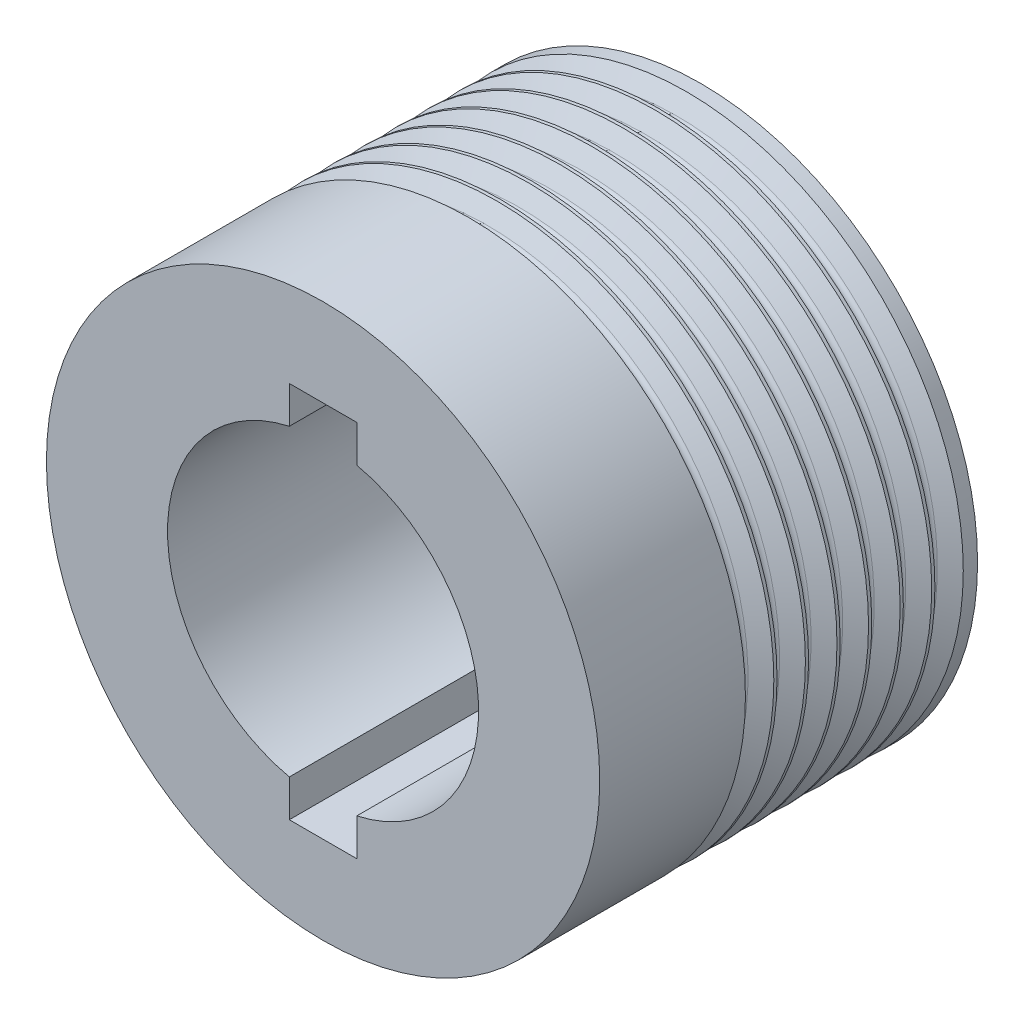
ISO-10303-21;
HEADER;
FILE_DESCRIPTION(('STEP AP214'),'2;1');
FILE_NAME('part.step','',(''),(''),'','','');
FILE_SCHEMA(('AUTOMOTIVE_DESIGN { 1 0 10303 214 1 1 1 1 }'));
ENDSEC;
DATA;
#1=APPLICATION_CONTEXT('core data for automotive mechanical design processes');
#2=APPLICATION_PROTOCOL_DEFINITION('international standard','automotive_design',2000,#1);
#3=PRODUCT_CONTEXT('',#1,'mechanical');
#4=PRODUCT('Part','Part','',(#3));
#5=PRODUCT_RELATED_PRODUCT_CATEGORY('part','',(#4));
#6=PRODUCT_DEFINITION_FORMATION('','',#4);
#7=PRODUCT_DEFINITION_CONTEXT('part definition',#1,'design');
#8=PRODUCT_DEFINITION('design','',#6,#7);
#9=PRODUCT_DEFINITION_SHAPE('','',#8);
#10=(LENGTH_UNIT() NAMED_UNIT(*) SI_UNIT(.MILLI.,.METRE.));
#11=(NAMED_UNIT(*) PLANE_ANGLE_UNIT() SI_UNIT($,.RADIAN.));
#12=(NAMED_UNIT(*) SI_UNIT($,.STERADIAN.) SOLID_ANGLE_UNIT());
#13=UNCERTAINTY_MEASURE_WITH_UNIT(LENGTH_MEASURE(1.E-05),#10,'distance_accuracy_value','');
#14=(GEOMETRIC_REPRESENTATION_CONTEXT(3) GLOBAL_UNCERTAINTY_ASSIGNED_CONTEXT((#13)) GLOBAL_UNIT_ASSIGNED_CONTEXT((#10,
#11,#12)) REPRESENTATION_CONTEXT('',''));
#15=CARTESIAN_POINT('',(0.,0.,0.));
#16=DIRECTION('',(0.,0.,1.));
#17=DIRECTION('',(1.,0.,0.));
#18=AXIS2_PLACEMENT_3D('',#15,#16,#17);
#19=CARTESIAN_POINT('',(0.,0.,28.));
#20=DIRECTION('',(0.,0.,-1.));
#21=DIRECTION('',(-1.,0.,0.));
#22=AXIS2_PLACEMENT_3D('',#19,#20,#21);
#23=CYLINDRICAL_SURFACE('',#22,11.525);
#24=DIRECTION('',(0.,0.,-1.));
#25=VECTOR('',#24,1.);
#26=CARTESIAN_POINT('',(2.5,-11.2505833182107,28.));
#27=LINE('',#26,#25);
#28=CARTESIAN_POINT('',(2.5,-11.2505833182107,28.));
#29=VERTEX_POINT('',#28);
#30=CARTESIAN_POINT('',(2.5,-11.2505833182107,0.));
#31=VERTEX_POINT('',#30);
#32=EDGE_CURVE('E11',#29,#31,#27,.T.);
#33=ORIENTED_EDGE('',*,*,#32,.F.);
#34=CARTESIAN_POINT('',(0.,0.,28.));
#35=DIRECTION('',(0.,0.,1.));
#36=DIRECTION('',(1.,0.,0.));
#37=AXIS2_PLACEMENT_3D('',#34,#35,#36);
#38=CIRCLE('',#37,11.525);
#39=CARTESIAN_POINT('',(2.5,11.2505833182107,28.));
#40=VERTEX_POINT('',#39);
#41=EDGE_CURVE('E125',#29,#40,#38,.T.);
#42=ORIENTED_EDGE('',*,*,#41,.T.);
#43=DIRECTION('',(0.,0.,-1.));
#44=VECTOR('',#43,1.);
#45=CARTESIAN_POINT('',(2.5,11.2505833182107,28.));
#46=LINE('',#45,#44);
#47=CARTESIAN_POINT('',(2.5,11.2505833182107,0.));
#48=VERTEX_POINT('',#47);
#49=EDGE_CURVE('E43',#48,#40,#46,.F.);
#50=ORIENTED_EDGE('',*,*,#49,.F.);
#51=CARTESIAN_POINT('',(0.,0.,0.));
#52=DIRECTION('',(0.,0.,1.));
#53=DIRECTION('',(1.,0.,0.));
#54=AXIS2_PLACEMENT_3D('',#51,#52,#53);
#55=CIRCLE('',#54,11.525);
#56=EDGE_CURVE('E193',#31,#48,#55,.T.);
#57=ORIENTED_EDGE('',*,*,#56,.F.);
#58=EDGE_LOOP('',(#33,#42,#50,#57));
#59=FACE_BOUND('',#58,.T.);
#60=ADVANCED_FACE('F35',(#59),#23,.F.);
#61=CARTESIAN_POINT('',(0.,0.,28.));
#62=DIRECTION('',(0.,0.,-1.));
#63=DIRECTION('',(-1.,0.,0.));
#64=AXIS2_PLACEMENT_3D('',#61,#62,#63);
#65=CYLINDRICAL_SURFACE('',#64,20.5);
#66=CARTESIAN_POINT('',(0.,0.,1.05849153852487));
#67=DIRECTION('',(0.,0.,-1.));
#68=DIRECTION('',(-1.,0.,0.));
#69=AXIS2_PLACEMENT_3D('',#66,#67,#68);
#70=CIRCLE('',#69,20.5);
#71=CARTESIAN_POINT('',(-20.5,0.,1.05849153852487));
#72=VERTEX_POINT('',#71);
#73=EDGE_CURVE('E196',#72,#72,#70,.T.);
#74=ORIENTED_EDGE('',*,*,#73,.T.);
#75=EDGE_LOOP('',(#74));
#76=FACE_BOUND('',#75,.T.);
#77=CARTESIAN_POINT('',(0.,0.,0.));
#78=DIRECTION('',(0.,0.,1.));
#79=DIRECTION('',(1.,0.,0.));
#80=AXIS2_PLACEMENT_3D('',#77,#78,#79);
#81=CIRCLE('',#80,20.5);
#82=CARTESIAN_POINT('',(20.5,0.,0.));
#83=VERTEX_POINT('',#82);
#84=EDGE_CURVE('E201',#83,#83,#81,.T.);
#85=ORIENTED_EDGE('',*,*,#84,.T.);
#86=EDGE_LOOP('',(#85));
#87=FACE_BOUND('',#86,.T.);
#88=ADVANCED_FACE('F281',(#76,#87),#65,.T.);
#89=CARTESIAN_POINT('',(0.,0.,17.2017394654647));
#90=DIRECTION('',(0.,0.,1.));
#91=DIRECTION('',(1.,0.,0.));
#92=AXIS2_PLACEMENT_3D('',#89,#90,#91);
#93=CIRCLE('',#92,20.5);
#94=CARTESIAN_POINT('',(20.5,0.,17.2017394654647));
#95=VERTEX_POINT('',#94);
#96=EDGE_CURVE('E206',#95,#95,#93,.T.);
#97=ORIENTED_EDGE('',*,*,#96,.T.);
#98=EDGE_LOOP('',(#97));
#99=FACE_BOUND('',#98,.T.);
#100=CARTESIAN_POINT('',(0.,0.,28.));
#101=DIRECTION('',(0.,0.,1.));
#102=DIRECTION('',(1.,0.,0.));
#103=AXIS2_PLACEMENT_3D('',#100,#101,#102);
#104=CIRCLE('',#103,20.5);
#105=CARTESIAN_POINT('',(20.5,0.,28.));
#106=VERTEX_POINT('',#105);
#107=EDGE_CURVE('E197',#106,#106,#104,.T.);
#108=ORIENTED_EDGE('',*,*,#107,.F.);
#109=EDGE_LOOP('',(#108));
#110=FACE_BOUND('',#109,.T.);
#111=ADVANCED_FACE('F286',(#99,#110),#65,.T.);
#112=CARTESIAN_POINT('',(0.,0.,28.));
#113=DIRECTION('',(0.,0.,1.));
#114=DIRECTION('',(1.,0.,0.));
#115=AXIS2_PLACEMENT_3D('',#112,#113,#114);
#116=PLANE('',#115);
#117=DIRECTION('',(0.,-1.,0.));
#118=VECTOR('',#117,1.);
#119=CARTESIAN_POINT('',(2.5,14.,28.));
#120=LINE('',#119,#118);
#121=CARTESIAN_POINT('',(2.5,14.,28.));
#122=VERTEX_POINT('',#121);
#123=EDGE_CURVE('E118',#122,#40,#120,.T.);
#124=ORIENTED_EDGE('',*,*,#123,.T.);
#125=ORIENTED_EDGE('',*,*,#41,.F.);
#126=CARTESIAN_POINT('',(2.5,-14.,28.));
#127=VERTEX_POINT('',#126);
#128=EDGE_CURVE('E102',#29,#127,#120,.T.);
#129=ORIENTED_EDGE('',*,*,#128,.T.);
#130=DIRECTION('',(-1.,0.,0.));
#131=VECTOR('',#130,1.);
#132=CARTESIAN_POINT('',(2.5,-14.,28.));
#133=LINE('',#132,#131);
#134=CARTESIAN_POINT('',(-2.5,-14.,28.));
#135=VERTEX_POINT('',#134);
#136=EDGE_CURVE('E113',#127,#135,#133,.T.);
#137=ORIENTED_EDGE('',*,*,#136,.T.);
#138=DIRECTION('',(0.,1.,0.));
#139=VECTOR('',#138,1.);
#140=CARTESIAN_POINT('',(-2.5,14.,28.));
#141=LINE('',#140,#139);
#142=CARTESIAN_POINT('',(-2.5,-11.2505833182107,28.));
#143=VERTEX_POINT('',#142);
#144=EDGE_CURVE('E131',#135,#143,#141,.T.);
#145=ORIENTED_EDGE('',*,*,#144,.T.);
#146=CARTESIAN_POINT('',(-2.5,11.2505833182107,28.));
#147=VERTEX_POINT('',#146);
#148=EDGE_CURVE('E191',#147,#143,#38,.T.);
#149=ORIENTED_EDGE('',*,*,#148,.F.);
#150=CARTESIAN_POINT('',(-2.5,14.,28.));
#151=VERTEX_POINT('',#150);
#152=EDGE_CURVE('E58',#147,#151,#141,.T.);
#153=ORIENTED_EDGE('',*,*,#152,.T.);
#154=DIRECTION('',(1.,0.,0.));
#155=VECTOR('',#154,1.);
#156=CARTESIAN_POINT('',(2.5,14.,28.));
#157=LINE('',#156,#155);
#158=EDGE_CURVE('E110',#151,#122,#157,.T.);
#159=ORIENTED_EDGE('',*,*,#158,.T.);
#160=EDGE_LOOP('',(#124,#125,#129,#137,#145,#149,#153,#159));
#161=FACE_BOUND('',#160,.T.);
#162=ORIENTED_EDGE('',*,*,#107,.T.);
#163=EDGE_LOOP('',(#162));
#164=FACE_BOUND('',#163,.T.);
#165=ADVANCED_FACE('F122',(#161,#164),#116,.T.);
#166=CARTESIAN_POINT('',(0.,0.,0.));
#167=DIRECTION('',(0.,0.,1.));
#168=DIRECTION('',(1.,0.,0.));
#169=AXIS2_PLACEMENT_3D('',#166,#167,#168);
#170=PLANE('',#169);
#171=ORIENTED_EDGE('',*,*,#84,.F.);
#172=EDGE_LOOP('',(#171));
#173=FACE_BOUND('',#172,.T.);
#174=ORIENTED_EDGE('',*,*,#56,.T.);
#175=DIRECTION('',(0.,-1.,0.));
#176=VECTOR('',#175,1.);
#177=CARTESIAN_POINT('',(2.5,14.,0.));
#178=LINE('',#177,#176);
#179=CARTESIAN_POINT('',(2.5,14.,0.));
#180=VERTEX_POINT('',#179);
#181=EDGE_CURVE('E135',#180,#48,#178,.T.);
#182=ORIENTED_EDGE('',*,*,#181,.F.);
#183=DIRECTION('',(1.,0.,0.));
#184=VECTOR('',#183,1.);
#185=CARTESIAN_POINT('',(2.5,14.,0.));
#186=LINE('',#185,#184);
#187=CARTESIAN_POINT('',(-2.5,14.,0.));
#188=VERTEX_POINT('',#187);
#189=EDGE_CURVE('E126',#188,#180,#186,.T.);
#190=ORIENTED_EDGE('',*,*,#189,.F.);
#191=DIRECTION('',(0.,1.,0.));
#192=VECTOR('',#191,1.);
#193=CARTESIAN_POINT('',(-2.5,14.,0.));
#194=LINE('',#193,#192);
#195=CARTESIAN_POINT('',(-2.5,11.2505833182107,0.));
#196=VERTEX_POINT('',#195);
#197=EDGE_CURVE('E139',#196,#188,#194,.T.);
#198=ORIENTED_EDGE('',*,*,#197,.F.);
#199=CARTESIAN_POINT('',(-2.5,-11.2505833182107,0.));
#200=VERTEX_POINT('',#199);
#201=EDGE_CURVE('E192',#196,#200,#55,.T.);
#202=ORIENTED_EDGE('',*,*,#201,.T.);
#203=CARTESIAN_POINT('',(-2.5,-14.,0.));
#204=VERTEX_POINT('',#203);
#205=EDGE_CURVE('E50',#204,#200,#194,.T.);
#206=ORIENTED_EDGE('',*,*,#205,.F.);
#207=DIRECTION('',(-1.,0.,0.));
#208=VECTOR('',#207,1.);
#209=CARTESIAN_POINT('',(2.5,-14.,0.));
#210=LINE('',#209,#208);
#211=CARTESIAN_POINT('',(2.5,-14.,0.));
#212=VERTEX_POINT('',#211);
#213=EDGE_CURVE('E137',#212,#204,#210,.T.);
#214=ORIENTED_EDGE('',*,*,#213,.F.);
#215=EDGE_CURVE('E105',#31,#212,#178,.T.);
#216=ORIENTED_EDGE('',*,*,#215,.F.);
#217=EDGE_LOOP('',(#174,#182,#190,#198,#202,#206,#214,#216));
#218=FACE_BOUND('',#217,.T.);
#219=ADVANCED_FACE('F255',(#173,#218),#170,.F.);
#220=DIRECTION('',(0.,0.,-1.));
#221=VECTOR('',#220,1.);
#222=CARTESIAN_POINT('',(-2.5,11.2505833182107,28.));
#223=LINE('',#222,#221);
#224=EDGE_CURVE('E245',#147,#196,#223,.T.);
#225=ORIENTED_EDGE('',*,*,#224,.F.);
#226=ORIENTED_EDGE('',*,*,#148,.T.);
#227=DIRECTION('',(0.,0.,-1.));
#228=VECTOR('',#227,1.);
#229=CARTESIAN_POINT('',(-2.5,-11.2505833182107,28.));
#230=LINE('',#229,#228);
#231=EDGE_CURVE('E200',#200,#143,#230,.F.);
#232=ORIENTED_EDGE('',*,*,#231,.F.);
#233=ORIENTED_EDGE('',*,*,#201,.F.);
#234=EDGE_LOOP('',(#225,#226,#232,#233));
#235=FACE_BOUND('',#234,.T.);
#236=ADVANCED_FACE('F261',(#235),#23,.F.);
#237=CARTESIAN_POINT('',(0.,0.,17.2599999999999));
#238=DIRECTION('',(0.,0.,1.));
#239=DIRECTION('',(1.,0.,0.));
#240=AXIS2_PLACEMENT_3D('',#237,#238,#239);
#241=CONICAL_SURFACE('',#240,20.5999999999999,1.04326521248382);
#242=CARTESIAN_POINT('',(0.,0.,16.4971337500661));
#243=DIRECTION('',(0.,0.,-1.));
#244=DIRECTION('',(-1.,0.,0.));
#245=AXIS2_PLACEMENT_3D('',#242,#243,#244);
#246=CIRCLE('',#245,19.2905951755875);
#247=CARTESIAN_POINT('',(-19.2905951755875,0.,16.4971337500661));
#248=VERTEX_POINT('',#247);
#249=EDGE_CURVE('E183',#248,#248,#246,.T.);
#250=ORIENTED_EDGE('',*,*,#249,.F.);
#251=EDGE_LOOP('',(#250));
#252=FACE_BOUND('',#251,.T.);
#253=ORIENTED_EDGE('',*,*,#96,.F.);
#254=EDGE_LOOP('',(#253));
#255=FACE_BOUND('',#254,.T.);
#256=ADVANCED_FACE('F292',(#252,#255),#241,.T.);
#257=CARTESIAN_POINT('',(0.,0.,15.8062391546756));
#258=DIRECTION('',(0.,0.,-1.));
#259=DIRECTION('',(-1.,0.,0.));
#260=AXIS2_PLACEMENT_3D('',#257,#258,#259);
#261=CONICAL_SURFACE('',#260,19.2899999999999,1.04154230006183);
#262=CARTESIAN_POINT('',(0.,0.,15.8062391546756));
#263=DIRECTION('',(0.,0.,-1.));
#264=DIRECTION('',(-1.,0.,0.));
#265=AXIS2_PLACEMENT_3D('',#262,#263,#264);
#266=CIRCLE('',#265,19.2899999999999);
#267=CARTESIAN_POINT('',(-19.2899999999999,0.,15.8062391546756));
#268=VERTEX_POINT('',#267);
#269=EDGE_CURVE('E143',#268,#268,#266,.T.);
#270=ORIENTED_EDGE('',*,*,#269,.T.);
#271=EDGE_LOOP('',(#270));
#272=FACE_BOUND('',#271,.T.);
#273=CARTESIAN_POINT('',(0.,0.,15.0984915385248));
#274=DIRECTION('',(0.,0.,-1.));
#275=DIRECTION('',(-1.,0.,0.));
#276=AXIS2_PLACEMENT_3D('',#273,#274,#275);
#277=CIRCLE('',#276,20.5);
#278=CARTESIAN_POINT('',(-20.5,0.,15.0984915385248));
#279=VERTEX_POINT('',#278);
#280=EDGE_CURVE('E155',#279,#279,#277,.T.);
#281=ORIENTED_EDGE('',*,*,#280,.F.);
#282=EDGE_LOOP('',(#281));
#283=FACE_BOUND('',#282,.T.);
#284=ADVANCED_FACE('F297',(#272,#283),#261,.T.);
#285=CARTESIAN_POINT('',(0.,0.,16.1515127325845));
#286=DIRECTION('',(0.,0.,-1.));
#287=DIRECTION('',(-1.,0.,0.));
#288=AXIS2_PLACEMENT_3D('',#285,#286,#287);
#289=TOROIDAL_SURFACE('',#288,19.4919558278386,0.400000000000001);
#290=ORIENTED_EDGE('',*,*,#269,.F.);
#291=EDGE_LOOP('',(#290));
#292=FACE_BOUND('',#291,.T.);
#293=ORIENTED_EDGE('',*,*,#249,.T.);
#294=EDGE_LOOP('',(#293));
#295=FACE_BOUND('',#294,.T.);
#296=ADVANCED_FACE('F385',(#292,#295),#289,.F.);
#297=CARTESIAN_POINT('',(0.,0.,1.76623915467571));
#298=DIRECTION('',(0.,0.,-1.));
#299=DIRECTION('',(-1.,0.,0.));
#300=AXIS2_PLACEMENT_3D('',#297,#298,#299);
#301=CONICAL_SURFACE('',#300,19.29,1.04154230006183);
#302=CARTESIAN_POINT('',(0.,0.,1.76623915467571));
#303=DIRECTION('',(0.,0.,-1.));
#304=DIRECTION('',(-1.,0.,0.));
#305=AXIS2_PLACEMENT_3D('',#302,#303,#304);
#306=CIRCLE('',#305,19.29);
#307=CARTESIAN_POINT('',(-19.29,0.,1.76623915467571));
#308=VERTEX_POINT('',#307);
#309=EDGE_CURVE('E148',#308,#308,#306,.T.);
#310=ORIENTED_EDGE('',*,*,#309,.T.);
#311=EDGE_LOOP('',(#310));
#312=FACE_BOUND('',#311,.T.);
#313=ORIENTED_EDGE('',*,*,#73,.F.);
#314=EDGE_LOOP('',(#313));
#315=FACE_BOUND('',#314,.T.);
#316=ADVANCED_FACE('F388',(#312,#315),#301,.T.);
#317=CARTESIAN_POINT('',(0.,0.,3.22000000000001));
#318=DIRECTION('',(0.,0.,1.));
#319=DIRECTION('',(1.,0.,0.));
#320=AXIS2_PLACEMENT_3D('',#317,#318,#319);
#321=CONICAL_SURFACE('',#320,20.6,1.04326521248382);
#322=CARTESIAN_POINT('',(0.,0.,2.45713375006612));
#323=DIRECTION('',(0.,0.,-1.));
#324=DIRECTION('',(-1.,0.,0.));
#325=AXIS2_PLACEMENT_3D('',#322,#323,#324);
#326=CIRCLE('',#325,19.2905951755876);
#327=CARTESIAN_POINT('',(-19.2905951755876,0.,2.45713375006612));
#328=VERTEX_POINT('',#327);
#329=EDGE_CURVE('E151',#328,#328,#326,.T.);
#330=ORIENTED_EDGE('',*,*,#329,.F.);
#331=EDGE_LOOP('',(#330));
#332=FACE_BOUND('',#331,.T.);
#333=CARTESIAN_POINT('',(0.,0.,3.1617394654647));
#334=DIRECTION('',(0.,0.,1.));
#335=DIRECTION('',(1.,0.,0.));
#336=AXIS2_PLACEMENT_3D('',#333,#334,#335);
#337=CIRCLE('',#336,20.5);
#338=CARTESIAN_POINT('',(20.5,0.,3.1617394654647));
#339=VERTEX_POINT('',#338);
#340=EDGE_CURVE('E239',#339,#339,#337,.T.);
#341=ORIENTED_EDGE('',*,*,#340,.F.);
#342=EDGE_LOOP('',(#341));
#343=FACE_BOUND('',#342,.T.);
#344=ADVANCED_FACE('F329',(#332,#343),#321,.T.);
#345=CARTESIAN_POINT('',(0.,0.,2.11151273258456));
#346=DIRECTION('',(0.,0.,-1.));
#347=DIRECTION('',(-1.,0.,0.));
#348=AXIS2_PLACEMENT_3D('',#345,#346,#347);
#349=TOROIDAL_SURFACE('',#348,19.4919558278387,0.4);
#350=ORIENTED_EDGE('',*,*,#309,.F.);
#351=EDGE_LOOP('',(#350));
#352=FACE_BOUND('',#351,.T.);
#353=ORIENTED_EDGE('',*,*,#329,.T.);
#354=EDGE_LOOP('',(#353));
#355=FACE_BOUND('',#354,.T.);
#356=ADVANCED_FACE('F319',(#352,#355),#349,.F.);
#357=CARTESIAN_POINT('',(0.,0.,14.8617394654647));
#358=DIRECTION('',(0.,0.,1.));
#359=DIRECTION('',(1.,0.,0.));
#360=AXIS2_PLACEMENT_3D('',#357,#358,#359);
#361=CIRCLE('',#360,20.5);
#362=CARTESIAN_POINT('',(20.5,0.,14.8617394654647));
#363=VERTEX_POINT('',#362);
#364=EDGE_CURVE('E212',#363,#363,#361,.T.);
#365=ORIENTED_EDGE('',*,*,#364,.T.);
#366=EDGE_LOOP('',(#365));
#367=FACE_BOUND('',#366,.T.);
#368=ORIENTED_EDGE('',*,*,#280,.T.);
#369=EDGE_LOOP('',(#368));
#370=FACE_BOUND('',#369,.T.);
#371=ADVANCED_FACE('F309',(#367,#370),#65,.T.);
#372=CARTESIAN_POINT('',(0.,0.,14.92));
#373=DIRECTION('',(0.,0.,1.));
#374=DIRECTION('',(1.,0.,0.));
#375=AXIS2_PLACEMENT_3D('',#372,#373,#374);
#376=CONICAL_SURFACE('',#375,20.5999999999999,1.04326521248382);
#377=CARTESIAN_POINT('',(0.,0.,14.1571337500661));
#378=DIRECTION('',(0.,0.,-1.));
#379=DIRECTION('',(-1.,0.,0.));
#380=AXIS2_PLACEMENT_3D('',#377,#378,#379);
#381=CIRCLE('',#380,19.2905951755875);
#382=CARTESIAN_POINT('',(-19.2905951755875,0.,14.1571337500661));
#383=VERTEX_POINT('',#382);
#384=EDGE_CURVE('E177',#383,#383,#381,.T.);
#385=ORIENTED_EDGE('',*,*,#384,.F.);
#386=EDGE_LOOP('',(#385));
#387=FACE_BOUND('',#386,.T.);
#388=ORIENTED_EDGE('',*,*,#364,.F.);
#389=EDGE_LOOP('',(#388));
#390=FACE_BOUND('',#389,.T.);
#391=ADVANCED_FACE('F318',(#387,#390),#376,.T.);
#392=CARTESIAN_POINT('',(0.,0.,13.4662391546757));
#393=DIRECTION('',(0.,0.,-1.));
#394=DIRECTION('',(-1.,0.,0.));
#395=AXIS2_PLACEMENT_3D('',#392,#393,#394);
#396=CONICAL_SURFACE('',#395,19.2899999999999,1.04154230006183);
#397=CARTESIAN_POINT('',(0.,0.,13.4662391546757));
#398=DIRECTION('',(0.,0.,-1.));
#399=DIRECTION('',(-1.,0.,0.));
#400=AXIS2_PLACEMENT_3D('',#397,#398,#399);
#401=CIRCLE('',#400,19.2899999999999);
#402=CARTESIAN_POINT('',(-19.2899999999999,0.,13.4662391546757));
#403=VERTEX_POINT('',#402);
#404=EDGE_CURVE('E180',#403,#403,#401,.T.);
#405=ORIENTED_EDGE('',*,*,#404,.T.);
#406=EDGE_LOOP('',(#405));
#407=FACE_BOUND('',#406,.T.);
#408=CARTESIAN_POINT('',(0.,0.,12.7584915385248));
#409=DIRECTION('',(0.,0.,-1.));
#410=DIRECTION('',(-1.,0.,0.));
#411=AXIS2_PLACEMENT_3D('',#408,#409,#410);
#412=CIRCLE('',#411,20.5);
#413=CARTESIAN_POINT('',(-20.5,0.,12.7584915385248));
#414=VERTEX_POINT('',#413);
#415=EDGE_CURVE('E209',#414,#414,#412,.T.);
#416=ORIENTED_EDGE('',*,*,#415,.F.);
#417=EDGE_LOOP('',(#416));
#418=FACE_BOUND('',#417,.T.);
#419=ADVANCED_FACE('F326',(#407,#418),#396,.T.);
#420=CARTESIAN_POINT('',(0.,0.,13.8115127325845));
#421=DIRECTION('',(0.,0.,-1.));
#422=DIRECTION('',(-1.,0.,0.));
#423=AXIS2_PLACEMENT_3D('',#420,#421,#422);
#424=TOROIDAL_SURFACE('',#423,19.4919558278386,0.4);
#425=ORIENTED_EDGE('',*,*,#404,.F.);
#426=EDGE_LOOP('',(#425));
#427=FACE_BOUND('',#426,.T.);
#428=ORIENTED_EDGE('',*,*,#384,.T.);
#429=EDGE_LOOP('',(#428));
#430=FACE_BOUND('',#429,.T.);
#431=ADVANCED_FACE('F315',(#427,#430),#424,.F.);
#432=ORIENTED_EDGE('',*,*,#340,.T.);
#433=EDGE_LOOP('',(#432));
#434=FACE_BOUND('',#433,.T.);
#435=CARTESIAN_POINT('',(0.,0.,3.39849153852485));
#436=DIRECTION('',(0.,0.,-1.));
#437=DIRECTION('',(-1.,0.,0.));
#438=AXIS2_PLACEMENT_3D('',#435,#436,#437);
#439=CIRCLE('',#438,20.5);
#440=CARTESIAN_POINT('',(-20.5,0.,3.39849153852485));
#441=VERTEX_POINT('',#440);
#442=EDGE_CURVE('E233',#441,#441,#439,.T.);
#443=ORIENTED_EDGE('',*,*,#442,.T.);
#444=EDGE_LOOP('',(#443));
#445=FACE_BOUND('',#444,.T.);
#446=ADVANCED_FACE('F37',(#434,#445),#65,.T.);
#447=CARTESIAN_POINT('',(0.,0.,5.56));
#448=DIRECTION('',(0.,0.,1.));
#449=DIRECTION('',(1.,0.,0.));
#450=AXIS2_PLACEMENT_3D('',#447,#448,#449);
#451=CONICAL_SURFACE('',#450,20.6,1.04326521248382);
#452=CARTESIAN_POINT('',(0.,0.,4.79713375006611));
#453=DIRECTION('',(0.,0.,-1.));
#454=DIRECTION('',(-1.,0.,0.));
#455=AXIS2_PLACEMENT_3D('',#452,#453,#454);
#456=CIRCLE('',#455,19.2905951755876);
#457=CARTESIAN_POINT('',(-19.2905951755876,0.,4.79713375006611));
#458=VERTEX_POINT('',#457);
#459=EDGE_CURVE('E152',#458,#458,#456,.T.);
#460=ORIENTED_EDGE('',*,*,#459,.F.);
#461=EDGE_LOOP('',(#460));
#462=FACE_BOUND('',#461,.T.);
#463=CARTESIAN_POINT('',(0.,0.,5.5017394654647));
#464=DIRECTION('',(0.,0.,1.));
#465=DIRECTION('',(1.,0.,0.));
#466=AXIS2_PLACEMENT_3D('',#463,#464,#465);
#467=CIRCLE('',#466,20.5);
#468=CARTESIAN_POINT('',(20.5,0.,5.5017394654647));
#469=VERTEX_POINT('',#468);
#470=EDGE_CURVE('E236',#469,#469,#467,.T.);
#471=ORIENTED_EDGE('',*,*,#470,.F.);
#472=EDGE_LOOP('',(#471));
#473=FACE_BOUND('',#472,.T.);
#474=ADVANCED_FACE('F314',(#462,#473),#451,.T.);
#475=CARTESIAN_POINT('',(0.,0.,4.1062391546757));
#476=DIRECTION('',(0.,0.,-1.));
#477=DIRECTION('',(-1.,0.,0.));
#478=AXIS2_PLACEMENT_3D('',#475,#476,#477);
#479=CONICAL_SURFACE('',#478,19.29,1.04154230006183);
#480=CARTESIAN_POINT('',(0.,0.,4.1062391546757));
#481=DIRECTION('',(0.,0.,-1.));
#482=DIRECTION('',(-1.,0.,0.));
#483=AXIS2_PLACEMENT_3D('',#480,#481,#482);
#484=CIRCLE('',#483,19.29);
#485=CARTESIAN_POINT('',(-19.29,0.,4.1062391546757));
#486=VERTEX_POINT('',#485);
#487=EDGE_CURVE('E156',#486,#486,#484,.T.);
#488=ORIENTED_EDGE('',*,*,#487,.T.);
#489=EDGE_LOOP('',(#488));
#490=FACE_BOUND('',#489,.T.);
#491=ORIENTED_EDGE('',*,*,#442,.F.);
#492=EDGE_LOOP('',(#491));
#493=FACE_BOUND('',#492,.T.);
#494=ADVANCED_FACE('F345',(#490,#493),#479,.T.);
#495=CARTESIAN_POINT('',(0.,0.,4.45151273258455));
#496=DIRECTION('',(0.,0.,-1.));
#497=DIRECTION('',(-1.,0.,0.));
#498=AXIS2_PLACEMENT_3D('',#495,#496,#497);
#499=TOROIDAL_SURFACE('',#498,19.4919558278387,0.4);
#500=ORIENTED_EDGE('',*,*,#487,.F.);
#501=EDGE_LOOP('',(#500));
#502=FACE_BOUND('',#501,.T.);
#503=ORIENTED_EDGE('',*,*,#459,.T.);
#504=EDGE_LOOP('',(#503));
#505=FACE_BOUND('',#504,.T.);
#506=ADVANCED_FACE('F335',(#502,#505),#499,.F.);
#507=CARTESIAN_POINT('',(0.,0.,12.5217394654647));
#508=DIRECTION('',(0.,0.,1.));
#509=DIRECTION('',(1.,0.,0.));
#510=AXIS2_PLACEMENT_3D('',#507,#508,#509);
#511=CIRCLE('',#510,20.5);
#512=CARTESIAN_POINT('',(20.5,0.,12.5217394654647));
#513=VERTEX_POINT('',#512);
#514=EDGE_CURVE('E218',#513,#513,#511,.T.);
#515=ORIENTED_EDGE('',*,*,#514,.T.);
#516=EDGE_LOOP('',(#515));
#517=FACE_BOUND('',#516,.T.);
#518=ORIENTED_EDGE('',*,*,#415,.T.);
#519=EDGE_LOOP('',(#518));
#520=FACE_BOUND('',#519,.T.);
#521=ADVANCED_FACE('F321',(#517,#520),#65,.T.);
#522=CARTESIAN_POINT('',(0.,0.,12.58));
#523=DIRECTION('',(0.,0.,1.));
#524=DIRECTION('',(1.,0.,0.));
#525=AXIS2_PLACEMENT_3D('',#522,#523,#524);
#526=CONICAL_SURFACE('',#525,20.5999999999999,1.04326521248382);
#527=CARTESIAN_POINT('',(0.,0.,11.8171337500661));
#528=DIRECTION('',(0.,0.,-1.));
#529=DIRECTION('',(-1.,0.,0.));
#530=AXIS2_PLACEMENT_3D('',#527,#528,#529);
#531=CIRCLE('',#530,19.2905951755875);
#532=CARTESIAN_POINT('',(-19.2905951755875,0.,11.8171337500661));
#533=VERTEX_POINT('',#532);
#534=EDGE_CURVE('E171',#533,#533,#531,.T.);
#535=ORIENTED_EDGE('',*,*,#534,.F.);
#536=EDGE_LOOP('',(#535));
#537=FACE_BOUND('',#536,.T.);
#538=ORIENTED_EDGE('',*,*,#514,.F.);
#539=EDGE_LOOP('',(#538));
#540=FACE_BOUND('',#539,.T.);
#541=ADVANCED_FACE('F334',(#537,#540),#526,.T.);
#542=CARTESIAN_POINT('',(0.,0.,11.1262391546757));
#543=DIRECTION('',(0.,0.,-1.));
#544=DIRECTION('',(-1.,0.,0.));
#545=AXIS2_PLACEMENT_3D('',#542,#543,#544);
#546=CONICAL_SURFACE('',#545,19.2899999999999,1.04154230006183);
#547=CARTESIAN_POINT('',(0.,0.,11.1262391546757));
#548=DIRECTION('',(0.,0.,-1.));
#549=DIRECTION('',(-1.,0.,0.));
#550=AXIS2_PLACEMENT_3D('',#547,#548,#549);
#551=CIRCLE('',#550,19.2899999999999);
#552=CARTESIAN_POINT('',(-19.2899999999999,0.,11.1262391546757));
#553=VERTEX_POINT('',#552);
#554=EDGE_CURVE('E174',#553,#553,#551,.T.);
#555=ORIENTED_EDGE('',*,*,#554,.T.);
#556=EDGE_LOOP('',(#555));
#557=FACE_BOUND('',#556,.T.);
#558=CARTESIAN_POINT('',(0.,0.,10.4184915385248));
#559=DIRECTION('',(0.,0.,-1.));
#560=DIRECTION('',(-1.,0.,0.));
#561=AXIS2_PLACEMENT_3D('',#558,#559,#560);
#562=CIRCLE('',#561,20.5);
#563=CARTESIAN_POINT('',(-20.5,0.,10.4184915385248));
#564=VERTEX_POINT('',#563);
#565=EDGE_CURVE('E215',#564,#564,#562,.T.);
#566=ORIENTED_EDGE('',*,*,#565,.F.);
#567=EDGE_LOOP('',(#566));
#568=FACE_BOUND('',#567,.T.);
#569=ADVANCED_FACE('F342',(#557,#568),#546,.T.);
#570=CARTESIAN_POINT('',(0.,0.,11.4715127325845));
#571=DIRECTION('',(0.,0.,-1.));
#572=DIRECTION('',(-1.,0.,0.));
#573=AXIS2_PLACEMENT_3D('',#570,#571,#572);
#574=TOROIDAL_SURFACE('',#573,19.4919558278387,0.400000000000001);
#575=ORIENTED_EDGE('',*,*,#554,.F.);
#576=EDGE_LOOP('',(#575));
#577=FACE_BOUND('',#576,.T.);
#578=ORIENTED_EDGE('',*,*,#534,.T.);
#579=EDGE_LOOP('',(#578));
#580=FACE_BOUND('',#579,.T.);
#581=ADVANCED_FACE('F367',(#577,#580),#574,.F.);
#582=ORIENTED_EDGE('',*,*,#470,.T.);
#583=EDGE_LOOP('',(#582));
#584=FACE_BOUND('',#583,.T.);
#585=CARTESIAN_POINT('',(0.,0.,5.73849153852483));
#586=DIRECTION('',(0.,0.,-1.));
#587=DIRECTION('',(-1.,0.,0.));
#588=AXIS2_PLACEMENT_3D('',#585,#586,#587);
#589=CIRCLE('',#588,20.5);
#590=CARTESIAN_POINT('',(-20.5,0.,5.73849153852483));
#591=VERTEX_POINT('',#590);
#592=EDGE_CURVE('E227',#591,#591,#589,.T.);
#593=ORIENTED_EDGE('',*,*,#592,.T.);
#594=EDGE_LOOP('',(#593));
#595=FACE_BOUND('',#594,.T.);
#596=ADVANCED_FACE('F288',(#584,#595),#65,.T.);
#597=CARTESIAN_POINT('',(0.,0.,7.89999999999999));
#598=DIRECTION('',(0.,0.,1.));
#599=DIRECTION('',(1.,0.,0.));
#600=AXIS2_PLACEMENT_3D('',#597,#598,#599);
#601=CONICAL_SURFACE('',#600,20.6,1.04326521248382);
#602=CARTESIAN_POINT('',(0.,0.,7.1371337500661));
#603=DIRECTION('',(0.,0.,-1.));
#604=DIRECTION('',(-1.,0.,0.));
#605=AXIS2_PLACEMENT_3D('',#602,#603,#604);
#606=CIRCLE('',#605,19.2905951755875);
#607=CARTESIAN_POINT('',(-19.2905951755875,0.,7.1371337500661));
#608=VERTEX_POINT('',#607);
#609=EDGE_CURVE('E159',#608,#608,#606,.T.);
#610=ORIENTED_EDGE('',*,*,#609,.F.);
#611=EDGE_LOOP('',(#610));
#612=FACE_BOUND('',#611,.T.);
#613=CARTESIAN_POINT('',(0.,0.,7.84173946546469));
#614=DIRECTION('',(0.,0.,1.));
#615=DIRECTION('',(1.,0.,0.));
#616=AXIS2_PLACEMENT_3D('',#613,#614,#615);
#617=CIRCLE('',#616,20.5);
#618=CARTESIAN_POINT('',(20.5,0.,7.84173946546469));
#619=VERTEX_POINT('',#618);
#620=EDGE_CURVE('E230',#619,#619,#617,.T.);
#621=ORIENTED_EDGE('',*,*,#620,.F.);
#622=EDGE_LOOP('',(#621));
#623=FACE_BOUND('',#622,.T.);
#624=ADVANCED_FACE('F416',(#612,#623),#601,.T.);
#625=CARTESIAN_POINT('',(0.,0.,6.44623915467569));
#626=DIRECTION('',(0.,0.,-1.));
#627=DIRECTION('',(-1.,0.,0.));
#628=AXIS2_PLACEMENT_3D('',#625,#626,#627);
#629=CONICAL_SURFACE('',#628,19.29,1.04154230006183);
#630=CARTESIAN_POINT('',(0.,0.,6.44623915467569));
#631=DIRECTION('',(0.,0.,-1.));
#632=DIRECTION('',(-1.,0.,0.));
#633=AXIS2_PLACEMENT_3D('',#630,#631,#632);
#634=CIRCLE('',#633,19.29);
#635=CARTESIAN_POINT('',(-19.29,0.,6.44623915467569));
#636=VERTEX_POINT('',#635);
#637=EDGE_CURVE('E162',#636,#636,#634,.T.);
#638=ORIENTED_EDGE('',*,*,#637,.T.);
#639=EDGE_LOOP('',(#638));
#640=FACE_BOUND('',#639,.T.);
#641=ORIENTED_EDGE('',*,*,#592,.F.);
#642=EDGE_LOOP('',(#641));
#643=FACE_BOUND('',#642,.T.);
#644=ADVANCED_FACE('F359',(#640,#643),#629,.T.);
#645=CARTESIAN_POINT('',(0.,0.,6.79151273258454));
#646=DIRECTION('',(0.,0.,-1.));
#647=DIRECTION('',(-1.,0.,0.));
#648=AXIS2_PLACEMENT_3D('',#645,#646,#647);
#649=TOROIDAL_SURFACE('',#648,19.4919558278387,0.4);
#650=ORIENTED_EDGE('',*,*,#637,.F.);
#651=EDGE_LOOP('',(#650));
#652=FACE_BOUND('',#651,.T.);
#653=ORIENTED_EDGE('',*,*,#609,.T.);
#654=EDGE_LOOP('',(#653));
#655=FACE_BOUND('',#654,.T.);
#656=ADVANCED_FACE('F351',(#652,#655),#649,.F.);
#657=CARTESIAN_POINT('',(0.,0.,10.1817394654647));
#658=DIRECTION('',(0.,0.,1.));
#659=DIRECTION('',(1.,0.,0.));
#660=AXIS2_PLACEMENT_3D('',#657,#658,#659);
#661=CIRCLE('',#660,20.5);
#662=CARTESIAN_POINT('',(20.5,0.,10.1817394654647));
#663=VERTEX_POINT('',#662);
#664=EDGE_CURVE('E224',#663,#663,#661,.T.);
#665=ORIENTED_EDGE('',*,*,#664,.T.);
#666=EDGE_LOOP('',(#665));
#667=FACE_BOUND('',#666,.T.);
#668=ORIENTED_EDGE('',*,*,#565,.T.);
#669=EDGE_LOOP('',(#668));
#670=FACE_BOUND('',#669,.T.);
#671=ADVANCED_FACE('F337',(#667,#670),#65,.T.);
#672=ORIENTED_EDGE('',*,*,#620,.T.);
#673=EDGE_LOOP('',(#672));
#674=FACE_BOUND('',#673,.T.);
#675=CARTESIAN_POINT('',(0.,0.,8.07849153852482));
#676=DIRECTION('',(0.,0.,-1.));
#677=DIRECTION('',(-1.,0.,0.));
#678=AXIS2_PLACEMENT_3D('',#675,#676,#677);
#679=CIRCLE('',#678,20.5);
#680=CARTESIAN_POINT('',(-20.5,0.,8.07849153852482));
#681=VERTEX_POINT('',#680);
#682=EDGE_CURVE('E221',#681,#681,#679,.T.);
#683=ORIENTED_EDGE('',*,*,#682,.T.);
#684=EDGE_LOOP('',(#683));
#685=FACE_BOUND('',#684,.T.);
#686=ADVANCED_FACE('F350',(#674,#685),#65,.T.);
#687=CARTESIAN_POINT('',(0.,0.,10.24));
#688=DIRECTION('',(0.,0.,1.));
#689=DIRECTION('',(1.,0.,0.));
#690=AXIS2_PLACEMENT_3D('',#687,#688,#689);
#691=CONICAL_SURFACE('',#690,20.6,1.04326521248382);
#692=CARTESIAN_POINT('',(0.,0.,9.47713375006609));
#693=DIRECTION('',(0.,0.,-1.));
#694=DIRECTION('',(-1.,0.,0.));
#695=AXIS2_PLACEMENT_3D('',#692,#693,#694);
#696=CIRCLE('',#695,19.2905951755875);
#697=CARTESIAN_POINT('',(-19.2905951755875,0.,9.47713375006609));
#698=VERTEX_POINT('',#697);
#699=EDGE_CURVE('E165',#698,#698,#696,.T.);
#700=ORIENTED_EDGE('',*,*,#699,.F.);
#701=EDGE_LOOP('',(#700));
#702=FACE_BOUND('',#701,.T.);
#703=ORIENTED_EDGE('',*,*,#664,.F.);
#704=EDGE_LOOP('',(#703));
#705=FACE_BOUND('',#704,.T.);
#706=ADVANCED_FACE('F357',(#702,#705),#691,.T.);
#707=CARTESIAN_POINT('',(0.,0.,8.78623915467568));
#708=DIRECTION('',(0.,0.,-1.));
#709=DIRECTION('',(-1.,0.,0.));
#710=AXIS2_PLACEMENT_3D('',#707,#708,#709);
#711=CONICAL_SURFACE('',#710,19.29,1.04154230006183);
#712=CARTESIAN_POINT('',(0.,0.,8.78623915467568));
#713=DIRECTION('',(0.,0.,-1.));
#714=DIRECTION('',(-1.,0.,0.));
#715=AXIS2_PLACEMENT_3D('',#712,#713,#714);
#716=CIRCLE('',#715,19.29);
#717=CARTESIAN_POINT('',(-19.29,0.,8.78623915467568));
#718=VERTEX_POINT('',#717);
#719=EDGE_CURVE('E168',#718,#718,#716,.T.);
#720=ORIENTED_EDGE('',*,*,#719,.T.);
#721=EDGE_LOOP('',(#720));
#722=FACE_BOUND('',#721,.T.);
#723=ORIENTED_EDGE('',*,*,#682,.F.);
#724=EDGE_LOOP('',(#723));
#725=FACE_BOUND('',#724,.T.);
#726=ADVANCED_FACE('F274',(#722,#725),#711,.T.);
#727=CARTESIAN_POINT('',(0.,0.,9.13151273258453));
#728=DIRECTION('',(0.,0.,-1.));
#729=DIRECTION('',(-1.,0.,0.));
#730=AXIS2_PLACEMENT_3D('',#727,#728,#729);
#731=TOROIDAL_SURFACE('',#730,19.4919558278387,0.4);
#732=ORIENTED_EDGE('',*,*,#719,.F.);
#733=EDGE_LOOP('',(#732));
#734=FACE_BOUND('',#733,.T.);
#735=ORIENTED_EDGE('',*,*,#699,.T.);
#736=EDGE_LOOP('',(#735));
#737=FACE_BOUND('',#736,.T.);
#738=ADVANCED_FACE('F266',(#734,#737),#731,.F.);
#739=CARTESIAN_POINT('',(-2.5,14.,28.));
#740=DIRECTION('',(-1.,0.,0.));
#741=DIRECTION('',(0.,-1.,0.));
#742=AXIS2_PLACEMENT_3D('',#739,#740,#741);
#743=PLANE('',#742);
#744=ORIENTED_EDGE('',*,*,#231,.T.);
#745=ORIENTED_EDGE('',*,*,#144,.F.);
#746=DIRECTION('',(0.,0.,-1.));
#747=VECTOR('',#746,1.);
#748=CARTESIAN_POINT('',(-2.5,-14.,28.));
#749=LINE('',#748,#747);
#750=EDGE_CURVE('E109',#135,#204,#749,.T.);
#751=ORIENTED_EDGE('',*,*,#750,.T.);
#752=ORIENTED_EDGE('',*,*,#205,.T.);
#753=EDGE_LOOP('',(#744,#745,#751,#752));
#754=FACE_BOUND('',#753,.T.);
#755=ADVANCED_FACE('F264',(#754),#743,.F.);
#756=CARTESIAN_POINT('',(2.5,14.,28.));
#757=DIRECTION('',(1.,0.,0.));
#758=DIRECTION('',(0.,1.,0.));
#759=AXIS2_PLACEMENT_3D('',#756,#757,#758);
#760=PLANE('',#759);
#761=ORIENTED_EDGE('',*,*,#32,.T.);
#762=ORIENTED_EDGE('',*,*,#215,.T.);
#763=DIRECTION('',(0.,0.,-1.));
#764=VECTOR('',#763,1.);
#765=CARTESIAN_POINT('',(2.5,-14.,28.));
#766=LINE('',#765,#764);
#767=EDGE_CURVE('E98',#127,#212,#766,.T.);
#768=ORIENTED_EDGE('',*,*,#767,.F.);
#769=ORIENTED_EDGE('',*,*,#128,.F.);
#770=EDGE_LOOP('',(#761,#762,#768,#769));
#771=FACE_BOUND('',#770,.T.);
#772=ADVANCED_FACE('F100',(#771),#760,.F.);
#773=CARTESIAN_POINT('',(2.5,-14.,28.));
#774=DIRECTION('',(0.,-1.,0.));
#775=DIRECTION('',(1.,0.,0.));
#776=AXIS2_PLACEMENT_3D('',#773,#774,#775);
#777=PLANE('',#776);
#778=ORIENTED_EDGE('',*,*,#213,.T.);
#779=ORIENTED_EDGE('',*,*,#750,.F.);
#780=ORIENTED_EDGE('',*,*,#136,.F.);
#781=ORIENTED_EDGE('',*,*,#767,.T.);
#782=EDGE_LOOP('',(#778,#779,#780,#781));
#783=FACE_BOUND('',#782,.T.);
#784=ADVANCED_FACE('F114',(#783),#777,.F.);
#785=ORIENTED_EDGE('',*,*,#224,.T.);
#786=ORIENTED_EDGE('',*,*,#197,.T.);
#787=DIRECTION('',(0.,0.,-1.));
#788=VECTOR('',#787,1.);
#789=CARTESIAN_POINT('',(-2.5,14.,28.));
#790=LINE('',#789,#788);
#791=EDGE_CURVE('E144',#151,#188,#790,.T.);
#792=ORIENTED_EDGE('',*,*,#791,.F.);
#793=ORIENTED_EDGE('',*,*,#152,.F.);
#794=EDGE_LOOP('',(#785,#786,#792,#793));
#795=FACE_BOUND('',#794,.T.);
#796=ADVANCED_FACE('F268',(#795),#743,.F.);
#797=ORIENTED_EDGE('',*,*,#49,.T.);
#798=ORIENTED_EDGE('',*,*,#123,.F.);
#799=DIRECTION('',(0.,0.,-1.));
#800=VECTOR('',#799,1.);
#801=CARTESIAN_POINT('',(2.5,14.,28.));
#802=LINE('',#801,#800);
#803=EDGE_CURVE('E141',#122,#180,#802,.T.);
#804=ORIENTED_EDGE('',*,*,#803,.T.);
#805=ORIENTED_EDGE('',*,*,#181,.T.);
#806=EDGE_LOOP('',(#797,#798,#804,#805));
#807=FACE_BOUND('',#806,.T.);
#808=ADVANCED_FACE('F249',(#807),#760,.F.);
#809=CARTESIAN_POINT('',(2.5,14.,28.));
#810=DIRECTION('',(0.,1.,0.));
#811=DIRECTION('',(-1.,0.,0.));
#812=AXIS2_PLACEMENT_3D('',#809,#810,#811);
#813=PLANE('',#812);
#814=ORIENTED_EDGE('',*,*,#189,.T.);
#815=ORIENTED_EDGE('',*,*,#803,.F.);
#816=ORIENTED_EDGE('',*,*,#158,.F.);
#817=ORIENTED_EDGE('',*,*,#791,.T.);
#818=EDGE_LOOP('',(#814,#815,#816,#817));
#819=FACE_BOUND('',#818,.T.);
#820=ADVANCED_FACE('F618',(#819),#813,.F.);
#821=CLOSED_SHELL('',(#60,#88,#111,#165,#219,#236,#256,#284,#296,#316,#344,#356,#371,#391,#419,
#431,#446,#474,#494,#506,#521,#541,#569,#581,#596,#624,#644,#656,#671,#686,#706,#726,#738,#755,
#772,#784,#796,#808,#820));
#822=MANIFOLD_SOLID_BREP('B2',#821);
#823=ADVANCED_BREP_SHAPE_REPRESENTATION('',(#18,#822),#14);
#824=SHAPE_DEFINITION_REPRESENTATION(#9,#823);
ENDSEC;
END-ISO-10303-21;
